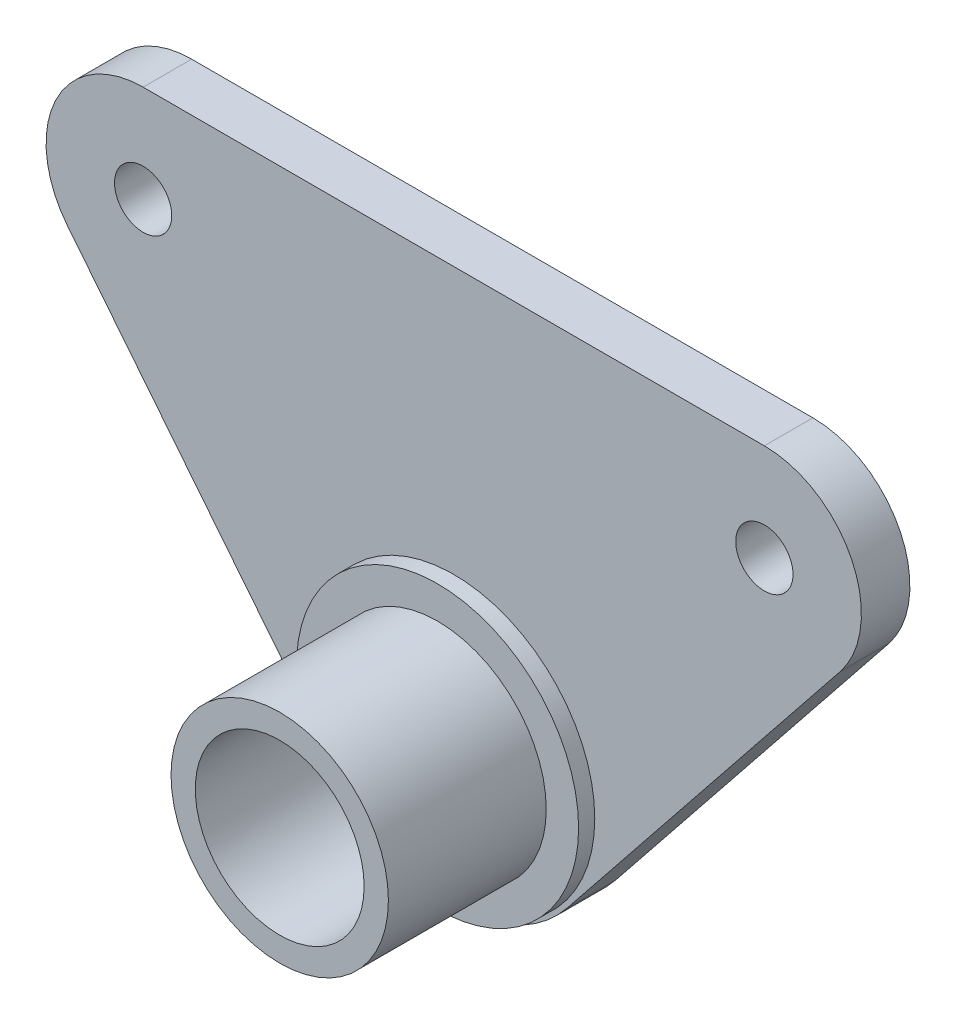
ISO-10303-21;
HEADER;
FILE_DESCRIPTION(('STEP AP214'),'2;1');
FILE_NAME('part.step','',(''),(''),'','','');
FILE_SCHEMA(('AUTOMOTIVE_DESIGN { 1 0 10303 214 1 1 1 1 }'));
ENDSEC;
DATA;
#1=APPLICATION_CONTEXT('core data for automotive mechanical design processes');
#2=APPLICATION_PROTOCOL_DEFINITION('international standard','automotive_design',2000,#1);
#3=PRODUCT_CONTEXT('',#1,'mechanical');
#4=PRODUCT('Part','Part','',(#3));
#5=PRODUCT_RELATED_PRODUCT_CATEGORY('part','',(#4));
#6=PRODUCT_DEFINITION_FORMATION('','',#4);
#7=PRODUCT_DEFINITION_CONTEXT('part definition',#1,'design');
#8=PRODUCT_DEFINITION('design','',#6,#7);
#9=PRODUCT_DEFINITION_SHAPE('','',#8);
#10=(LENGTH_UNIT() NAMED_UNIT(*) SI_UNIT(.MILLI.,.METRE.));
#11=(NAMED_UNIT(*) PLANE_ANGLE_UNIT() SI_UNIT($,.RADIAN.));
#12=(NAMED_UNIT(*) SI_UNIT($,.STERADIAN.) SOLID_ANGLE_UNIT());
#13=UNCERTAINTY_MEASURE_WITH_UNIT(LENGTH_MEASURE(1.E-05),#10,'distance_accuracy_value','');
#14=(GEOMETRIC_REPRESENTATION_CONTEXT(3) GLOBAL_UNCERTAINTY_ASSIGNED_CONTEXT((#13)) GLOBAL_UNIT_ASSIGNED_CONTEXT((#10,
#11,#12)) REPRESENTATION_CONTEXT('',''));
#15=CARTESIAN_POINT('',(0.,0.,0.));
#16=DIRECTION('',(0.,0.,1.));
#17=DIRECTION('',(1.,0.,0.));
#18=AXIS2_PLACEMENT_3D('',#15,#16,#17);
#19=CARTESIAN_POINT('',(0.,0.,3.81));
#20=DIRECTION('',(0.,0.,1.));
#21=DIRECTION('',(1.,0.,0.));
#22=AXIS2_PLACEMENT_3D('',#19,#20,#21);
#23=PLANE('',#22);
#24=CARTESIAN_POINT('',(-24.39,24.39,3.81));
#25=DIRECTION('',(0.,0.,1.));
#26=DIRECTION('',(1.,0.,0.));
#27=AXIS2_PLACEMENT_3D('',#24,#25,#26);
#28=CIRCLE('',#27,2.2479);
#29=CARTESIAN_POINT('',(-22.1421,24.39,3.81));
#30=VERTEX_POINT('',#29);
#31=EDGE_CURVE('E172',#30,#30,#28,.T.);
#32=ORIENTED_EDGE('',*,*,#31,.F.);
#33=EDGE_LOOP('',(#32));
#34=FACE_BOUND('',#33,.T.);
#35=CARTESIAN_POINT('',(24.39,24.39,3.81));
#36=DIRECTION('',(0.,0.,1.));
#37=DIRECTION('',(1.,0.,0.));
#38=AXIS2_PLACEMENT_3D('',#35,#36,#37);
#39=CIRCLE('',#38,2.2479);
#40=CARTESIAN_POINT('',(26.6379,24.39,3.81));
#41=VERTEX_POINT('',#40);
#42=EDGE_CURVE('E166',#41,#41,#39,.T.);
#43=ORIENTED_EDGE('',*,*,#42,.F.);
#44=EDGE_LOOP('',(#43));
#45=FACE_BOUND('',#44,.T.);
#46=CARTESIAN_POINT('',(0.,0.,3.81));
#47=DIRECTION('',(0.,0.,1.));
#48=DIRECTION('',(1.,0.,0.));
#49=AXIS2_PLACEMENT_3D('',#46,#47,#48);
#50=CIRCLE('',#49,11.0744);
#51=CARTESIAN_POINT('',(11.0744,0.,3.81));
#52=VERTEX_POINT('',#51);
#53=EDGE_CURVE('E11',#52,#52,#50,.T.);
#54=ORIENTED_EDGE('',*,*,#53,.F.);
#55=EDGE_LOOP('',(#54));
#56=FACE_BOUND('',#55,.T.);
#57=CARTESIAN_POINT('',(0.,0.,3.81));
#58=DIRECTION('',(0.,0.,1.));
#59=DIRECTION('',(1.,0.,0.));
#60=AXIS2_PLACEMENT_3D('',#57,#58,#59);
#61=CIRCLE('',#60,11.43);
#62=CARTESIAN_POINT('',(-8.92552251414634,-7.1400243591648,3.81));
#63=VERTEX_POINT('',#62);
#64=CARTESIAN_POINT('',(8.92552251414635,-7.1400243591648,3.81));
#65=VERTEX_POINT('',#64);
#66=EDGE_CURVE('E130',#63,#65,#61,.T.);
#67=ORIENTED_EDGE('',*,*,#66,.T.);
#68=DIRECTION('',(0.624674047171023,0.780885609286645,0.));
#69=VECTOR('',#68,1.);
#70=CARTESIAN_POINT('',(8.92552251414635,-7.1400243591648,3.81));
#71=LINE('',#70,#69);
#72=CARTESIAN_POINT('',(30.3403483427642,19.6299837605568,3.81));
#73=VERTEX_POINT('',#72);
#74=EDGE_CURVE('E89',#65,#73,#71,.T.);
#75=ORIENTED_EDGE('',*,*,#74,.T.);
#76=CARTESIAN_POINT('',(24.39,24.39,3.81));
#77=DIRECTION('',(0.,0.,1.));
#78=DIRECTION('',(1.,0.,0.));
#79=AXIS2_PLACEMENT_3D('',#76,#77,#78);
#80=CIRCLE('',#79,7.62);
#81=CARTESIAN_POINT('',(24.39,32.01,3.81));
#82=VERTEX_POINT('',#81);
#83=EDGE_CURVE('E101',#73,#82,#80,.T.);
#84=ORIENTED_EDGE('',*,*,#83,.T.);
#85=DIRECTION('',(-1.,0.,0.));
#86=VECTOR('',#85,1.);
#87=CARTESIAN_POINT('',(-24.39,32.01,3.81));
#88=LINE('',#87,#86);
#89=CARTESIAN_POINT('',(-24.39,32.01,3.81));
#90=VERTEX_POINT('',#89);
#91=EDGE_CURVE('E96',#82,#90,#88,.T.);
#92=ORIENTED_EDGE('',*,*,#91,.T.);
#93=CARTESIAN_POINT('',(-24.39,24.39,3.81));
#94=DIRECTION('',(0.,0.,1.));
#95=DIRECTION('',(-1.,0.,0.));
#96=AXIS2_PLACEMENT_3D('',#93,#94,#95);
#97=CIRCLE('',#96,7.62);
#98=CARTESIAN_POINT('',(-30.3403483427642,19.6299837605568,3.81));
#99=VERTEX_POINT('',#98);
#100=EDGE_CURVE('E99',#90,#99,#97,.T.);
#101=ORIENTED_EDGE('',*,*,#100,.T.);
#102=DIRECTION('',(0.624674047171024,-0.780885609286644,0.));
#103=VECTOR('',#102,1.);
#104=CARTESIAN_POINT('',(-8.92552251414634,-7.1400243591648,3.81));
#105=LINE('',#104,#103);
#106=EDGE_CURVE('E51',#99,#63,#105,.T.);
#107=ORIENTED_EDGE('',*,*,#106,.T.);
#108=EDGE_LOOP('',(#67,#75,#84,#92,#101,#107));
#109=FACE_BOUND('',#108,.T.);
#110=ADVANCED_FACE('F33',(#34,#45,#56,#109),#23,.T.);
#111=CARTESIAN_POINT('',(0.,0.,3.81));
#112=DIRECTION('',(0.,0.,-1.));
#113=DIRECTION('',(-1.,0.,0.));
#114=AXIS2_PLACEMENT_3D('',#111,#112,#113);
#115=CYLINDRICAL_SURFACE('',#114,11.43);
#116=CARTESIAN_POINT('',(0.,0.,0.));
#117=DIRECTION('',(0.,0.,1.));
#118=DIRECTION('',(1.,0.,0.));
#119=AXIS2_PLACEMENT_3D('',#116,#117,#118);
#120=CIRCLE('',#119,11.43);
#121=CARTESIAN_POINT('',(-8.92552251414634,-7.1400243591648,0.));
#122=VERTEX_POINT('',#121);
#123=CARTESIAN_POINT('',(8.92552251414635,-7.1400243591648,0.));
#124=VERTEX_POINT('',#123);
#125=EDGE_CURVE('E119',#122,#124,#120,.T.);
#126=ORIENTED_EDGE('',*,*,#125,.T.);
#127=DIRECTION('',(0.,0.,-1.));
#128=VECTOR('',#127,1.);
#129=CARTESIAN_POINT('',(8.92552251414635,-7.1400243591648,3.81));
#130=LINE('',#129,#128);
#131=EDGE_CURVE('E37',#65,#124,#130,.T.);
#132=ORIENTED_EDGE('',*,*,#131,.F.);
#133=ORIENTED_EDGE('',*,*,#66,.F.);
#134=DIRECTION('',(0.,0.,-1.));
#135=VECTOR('',#134,1.);
#136=CARTESIAN_POINT('',(-8.92552251414634,-7.1400243591648,3.81));
#137=LINE('',#136,#135);
#138=EDGE_CURVE('E115',#63,#122,#137,.T.);
#139=ORIENTED_EDGE('',*,*,#138,.T.);
#140=EDGE_LOOP('',(#126,#132,#133,#139));
#141=FACE_BOUND('',#140,.T.);
#142=ADVANCED_FACE('F35',(#141),#115,.T.);
#143=CARTESIAN_POINT('',(8.92552251414635,-7.1400243591648,3.81));
#144=DIRECTION('',(-0.780885609286645,0.624674047171023,0.));
#145=DIRECTION('',(-0.624674047171023,-0.780885609286645,0.));
#146=AXIS2_PLACEMENT_3D('',#143,#144,#145);
#147=PLANE('',#146);
#148=DIRECTION('',(0.624674047171023,0.780885609286645,0.));
#149=VECTOR('',#148,1.);
#150=CARTESIAN_POINT('',(8.92552251414635,-7.1400243591648,0.));
#151=LINE('',#150,#149);
#152=CARTESIAN_POINT('',(30.3403483427642,19.6299837605568,0.));
#153=VERTEX_POINT('',#152);
#154=EDGE_CURVE('E122',#124,#153,#151,.T.);
#155=ORIENTED_EDGE('',*,*,#154,.T.);
#156=DIRECTION('',(0.,0.,-1.));
#157=VECTOR('',#156,1.);
#158=CARTESIAN_POINT('',(30.3403483427642,19.6299837605568,3.81));
#159=LINE('',#158,#157);
#160=EDGE_CURVE('E133',#73,#153,#159,.T.);
#161=ORIENTED_EDGE('',*,*,#160,.F.);
#162=ORIENTED_EDGE('',*,*,#74,.F.);
#163=ORIENTED_EDGE('',*,*,#131,.T.);
#164=EDGE_LOOP('',(#155,#161,#162,#163));
#165=FACE_BOUND('',#164,.T.);
#166=ADVANCED_FACE('F138',(#165),#147,.F.);
#167=CARTESIAN_POINT('',(24.39,24.39,3.81));
#168=DIRECTION('',(0.,0.,-1.));
#169=DIRECTION('',(-1.,0.,0.));
#170=AXIS2_PLACEMENT_3D('',#167,#168,#169);
#171=CYLINDRICAL_SURFACE('',#170,7.62);
#172=CARTESIAN_POINT('',(24.39,24.39,0.));
#173=DIRECTION('',(0.,0.,1.));
#174=DIRECTION('',(1.,0.,0.));
#175=AXIS2_PLACEMENT_3D('',#172,#173,#174);
#176=CIRCLE('',#175,7.62);
#177=CARTESIAN_POINT('',(24.39,32.01,0.));
#178=VERTEX_POINT('',#177);
#179=EDGE_CURVE('E125',#153,#178,#176,.T.);
#180=ORIENTED_EDGE('',*,*,#179,.T.);
#181=DIRECTION('',(0.,0.,-1.));
#182=VECTOR('',#181,1.);
#183=CARTESIAN_POINT('',(24.39,32.01,3.81));
#184=LINE('',#183,#182);
#185=EDGE_CURVE('E110',#82,#178,#184,.T.);
#186=ORIENTED_EDGE('',*,*,#185,.F.);
#187=ORIENTED_EDGE('',*,*,#83,.F.);
#188=ORIENTED_EDGE('',*,*,#160,.T.);
#189=EDGE_LOOP('',(#180,#186,#187,#188));
#190=FACE_BOUND('',#189,.T.);
#191=ADVANCED_FACE('F145',(#190),#171,.T.);
#192=CARTESIAN_POINT('',(-24.39,32.01,3.81));
#193=DIRECTION('',(0.,-1.,0.));
#194=DIRECTION('',(0.,0.,-1.));
#195=AXIS2_PLACEMENT_3D('',#192,#193,#194);
#196=PLANE('',#195);
#197=DIRECTION('',(-1.,0.,0.));
#198=VECTOR('',#197,1.);
#199=CARTESIAN_POINT('',(-24.39,32.01,0.));
#200=LINE('',#199,#198);
#201=CARTESIAN_POINT('',(-24.39,32.01,0.));
#202=VERTEX_POINT('',#201);
#203=EDGE_CURVE('E109',#178,#202,#200,.T.);
#204=ORIENTED_EDGE('',*,*,#203,.T.);
#205=DIRECTION('',(0.,0.,-1.));
#206=VECTOR('',#205,1.);
#207=CARTESIAN_POINT('',(-24.39,32.01,3.81));
#208=LINE('',#207,#206);
#209=EDGE_CURVE('E106',#90,#202,#208,.T.);
#210=ORIENTED_EDGE('',*,*,#209,.F.);
#211=ORIENTED_EDGE('',*,*,#91,.F.);
#212=ORIENTED_EDGE('',*,*,#185,.T.);
#213=EDGE_LOOP('',(#204,#210,#211,#212));
#214=FACE_BOUND('',#213,.T.);
#215=ADVANCED_FACE('F107',(#214),#196,.F.);
#216=CARTESIAN_POINT('',(-24.39,24.39,3.81));
#217=DIRECTION('',(0.,0.,-1.));
#218=DIRECTION('',(-1.,0.,0.));
#219=AXIS2_PLACEMENT_3D('',#216,#217,#218);
#220=CYLINDRICAL_SURFACE('',#219,7.62);
#221=CARTESIAN_POINT('',(-24.39,24.39,0.));
#222=DIRECTION('',(0.,0.,1.));
#223=DIRECTION('',(-1.,0.,0.));
#224=AXIS2_PLACEMENT_3D('',#221,#222,#223);
#225=CIRCLE('',#224,7.62);
#226=CARTESIAN_POINT('',(-30.3403483427642,19.6299837605568,0.));
#227=VERTEX_POINT('',#226);
#228=EDGE_CURVE('E74',#202,#227,#225,.T.);
#229=ORIENTED_EDGE('',*,*,#228,.T.);
#230=DIRECTION('',(0.,0.,-1.));
#231=VECTOR('',#230,1.);
#232=CARTESIAN_POINT('',(-30.3403483427642,19.6299837605568,3.81));
#233=LINE('',#232,#231);
#234=EDGE_CURVE('E111',#99,#227,#233,.T.);
#235=ORIENTED_EDGE('',*,*,#234,.F.);
#236=ORIENTED_EDGE('',*,*,#100,.F.);
#237=ORIENTED_EDGE('',*,*,#209,.T.);
#238=EDGE_LOOP('',(#229,#235,#236,#237));
#239=FACE_BOUND('',#238,.T.);
#240=ADVANCED_FACE('F113',(#239),#220,.T.);
#241=CARTESIAN_POINT('',(-8.92552251414634,-7.1400243591648,3.81));
#242=DIRECTION('',(0.780885609286644,0.624674047171024,0.));
#243=DIRECTION('',(-0.624674047171024,0.780885609286644,0.));
#244=AXIS2_PLACEMENT_3D('',#241,#242,#243);
#245=PLANE('',#244);
#246=DIRECTION('',(0.624674047171024,-0.780885609286644,0.));
#247=VECTOR('',#246,1.);
#248=CARTESIAN_POINT('',(-8.92552251414634,-7.1400243591648,0.));
#249=LINE('',#248,#247);
#250=EDGE_CURVE('E80',#227,#122,#249,.T.);
#251=ORIENTED_EDGE('',*,*,#250,.T.);
#252=ORIENTED_EDGE('',*,*,#138,.F.);
#253=ORIENTED_EDGE('',*,*,#106,.F.);
#254=ORIENTED_EDGE('',*,*,#234,.T.);
#255=EDGE_LOOP('',(#251,#252,#253,#254));
#256=FACE_BOUND('',#255,.T.);
#257=ADVANCED_FACE('F216',(#256),#245,.F.);
#258=CARTESIAN_POINT('',(0.,0.,0.));
#259=DIRECTION('',(0.,0.,1.));
#260=DIRECTION('',(1.,0.,0.));
#261=AXIS2_PLACEMENT_3D('',#258,#259,#260);
#262=PLANE('',#261);
#263=CARTESIAN_POINT('',(-24.39,24.39,0.));
#264=DIRECTION('',(0.,0.,1.));
#265=DIRECTION('',(1.,0.,0.));
#266=AXIS2_PLACEMENT_3D('',#263,#264,#265);
#267=CIRCLE('',#266,2.2479);
#268=CARTESIAN_POINT('',(-22.1421,24.39,0.));
#269=VERTEX_POINT('',#268);
#270=EDGE_CURVE('E169',#269,#269,#267,.T.);
#271=ORIENTED_EDGE('',*,*,#270,.T.);
#272=EDGE_LOOP('',(#271));
#273=FACE_BOUND('',#272,.T.);
#274=CARTESIAN_POINT('',(24.39,24.39,0.));
#275=DIRECTION('',(0.,0.,1.));
#276=DIRECTION('',(1.,0.,0.));
#277=AXIS2_PLACEMENT_3D('',#274,#275,#276);
#278=CIRCLE('',#277,2.2479);
#279=CARTESIAN_POINT('',(26.6379,24.39,0.));
#280=VERTEX_POINT('',#279);
#281=EDGE_CURVE('E163',#280,#280,#278,.T.);
#282=ORIENTED_EDGE('',*,*,#281,.T.);
#283=EDGE_LOOP('',(#282));
#284=FACE_BOUND('',#283,.T.);
#285=ORIENTED_EDGE('',*,*,#125,.F.);
#286=ORIENTED_EDGE('',*,*,#250,.F.);
#287=ORIENTED_EDGE('',*,*,#228,.F.);
#288=ORIENTED_EDGE('',*,*,#203,.F.);
#289=ORIENTED_EDGE('',*,*,#179,.F.);
#290=ORIENTED_EDGE('',*,*,#154,.F.);
#291=EDGE_LOOP('',(#285,#286,#287,#288,#289,#290));
#292=FACE_BOUND('',#291,.T.);
#293=CARTESIAN_POINT('',(0.,0.,0.));
#294=DIRECTION('',(0.,0.,1.));
#295=DIRECTION('',(1.,0.,0.));
#296=AXIS2_PLACEMENT_3D('',#293,#294,#295);
#297=CIRCLE('',#296,6.6294);
#298=CARTESIAN_POINT('',(6.6294,0.,0.));
#299=VERTEX_POINT('',#298);
#300=EDGE_CURVE('E154',#299,#299,#297,.T.);
#301=ORIENTED_EDGE('',*,*,#300,.T.);
#302=EDGE_LOOP('',(#301));
#303=FACE_BOUND('',#302,.T.);
#304=ADVANCED_FACE('F143',(#273,#284,#292,#303),#262,.F.);
#305=CARTESIAN_POINT('',(0.,0.,17.4752));
#306=DIRECTION('',(0.,0.,1.));
#307=DIRECTION('',(1.,0.,0.));
#308=AXIS2_PLACEMENT_3D('',#305,#306,#307);
#309=PLANE('',#308);
#310=CARTESIAN_POINT('',(0.,0.,17.4752));
#311=DIRECTION('',(0.,0.,1.));
#312=DIRECTION('',(1.,0.,0.));
#313=AXIS2_PLACEMENT_3D('',#310,#311,#312);
#314=CIRCLE('',#313,8.5344);
#315=CARTESIAN_POINT('',(8.5344,0.,17.4752));
#316=VERTEX_POINT('',#315);
#317=EDGE_CURVE('E123',#316,#316,#314,.T.);
#318=ORIENTED_EDGE('',*,*,#317,.T.);
#319=EDGE_LOOP('',(#318));
#320=FACE_BOUND('',#319,.T.);
#321=CARTESIAN_POINT('',(0.,0.,17.4752));
#322=DIRECTION('',(0.,0.,1.));
#323=DIRECTION('',(1.,0.,0.));
#324=AXIS2_PLACEMENT_3D('',#321,#322,#323);
#325=CIRCLE('',#324,6.6294);
#326=CARTESIAN_POINT('',(6.6294,0.,17.4752));
#327=VERTEX_POINT('',#326);
#328=EDGE_CURVE('E151',#327,#327,#325,.T.);
#329=ORIENTED_EDGE('',*,*,#328,.F.);
#330=EDGE_LOOP('',(#329));
#331=FACE_BOUND('',#330,.T.);
#332=ADVANCED_FACE('F202',(#320,#331),#309,.T.);
#333=CARTESIAN_POINT('',(0.,0.,17.4752));
#334=DIRECTION('',(0.,0.,-1.));
#335=DIRECTION('',(-1.,0.,0.));
#336=AXIS2_PLACEMENT_3D('',#333,#334,#335);
#337=CYLINDRICAL_SURFACE('',#336,8.5344);
#338=CARTESIAN_POINT('',(0.,0.,5.08));
#339=DIRECTION('',(0.,0.,1.));
#340=DIRECTION('',(1.,0.,0.));
#341=AXIS2_PLACEMENT_3D('',#338,#339,#340);
#342=CIRCLE('',#341,8.5344);
#343=CARTESIAN_POINT('',(8.5344,0.,5.08));
#344=VERTEX_POINT('',#343);
#345=EDGE_CURVE('E160',#344,#344,#342,.T.);
#346=ORIENTED_EDGE('',*,*,#345,.T.);
#347=EDGE_LOOP('',(#346));
#348=FACE_BOUND('',#347,.T.);
#349=ORIENTED_EDGE('',*,*,#317,.F.);
#350=EDGE_LOOP('',(#349));
#351=FACE_BOUND('',#350,.T.);
#352=ADVANCED_FACE('F199',(#348,#351),#337,.T.);
#353=CARTESIAN_POINT('',(0.,0.,17.4752));
#354=DIRECTION('',(0.,0.,-1.));
#355=DIRECTION('',(-1.,0.,0.));
#356=AXIS2_PLACEMENT_3D('',#353,#354,#355);
#357=CYLINDRICAL_SURFACE('',#356,6.6294);
#358=ORIENTED_EDGE('',*,*,#328,.T.);
#359=EDGE_LOOP('',(#358));
#360=FACE_BOUND('',#359,.T.);
#361=ORIENTED_EDGE('',*,*,#300,.F.);
#362=EDGE_LOOP('',(#361));
#363=FACE_BOUND('',#362,.T.);
#364=ADVANCED_FACE('F189',(#360,#363),#357,.F.);
#365=CARTESIAN_POINT('',(0.,0.,-31.3231333502892));
#366=DIRECTION('',(0.,0.,1.));
#367=DIRECTION('',(1.,0.,0.));
#368=AXIS2_PLACEMENT_3D('',#365,#366,#367);
#369=CYLINDRICAL_SURFACE('',#368,11.0744);
#370=ORIENTED_EDGE('',*,*,#53,.T.);
#371=EDGE_LOOP('',(#370));
#372=FACE_BOUND('',#371,.T.);
#373=CARTESIAN_POINT('',(0.,0.,5.08));
#374=DIRECTION('',(0.,0.,1.));
#375=DIRECTION('',(1.,0.,0.));
#376=AXIS2_PLACEMENT_3D('',#373,#374,#375);
#377=CIRCLE('',#376,11.0744);
#378=CARTESIAN_POINT('',(11.0744,0.,5.08));
#379=VERTEX_POINT('',#378);
#380=EDGE_CURVE('E156',#379,#379,#377,.T.);
#381=ORIENTED_EDGE('',*,*,#380,.F.);
#382=EDGE_LOOP('',(#381));
#383=FACE_BOUND('',#382,.T.);
#384=ADVANCED_FACE('F185',(#372,#383),#369,.T.);
#385=CARTESIAN_POINT('',(0.,0.,5.08));
#386=DIRECTION('',(0.,0.,1.));
#387=DIRECTION('',(1.,0.,0.));
#388=AXIS2_PLACEMENT_3D('',#385,#386,#387);
#389=PLANE('',#388);
#390=ORIENTED_EDGE('',*,*,#380,.T.);
#391=EDGE_LOOP('',(#390));
#392=FACE_BOUND('',#391,.T.);
#393=ORIENTED_EDGE('',*,*,#345,.F.);
#394=EDGE_LOOP('',(#393));
#395=FACE_BOUND('',#394,.T.);
#396=ADVANCED_FACE('F188',(#392,#395),#389,.T.);
#397=CARTESIAN_POINT('',(24.39,24.39,3.81));
#398=DIRECTION('',(0.,0.,1.));
#399=DIRECTION('',(1.,0.,0.));
#400=AXIS2_PLACEMENT_3D('',#397,#398,#399);
#401=CYLINDRICAL_SURFACE('',#400,2.2479);
#402=ORIENTED_EDGE('',*,*,#281,.F.);
#403=EDGE_LOOP('',(#402));
#404=FACE_BOUND('',#403,.T.);
#405=ORIENTED_EDGE('',*,*,#42,.T.);
#406=EDGE_LOOP('',(#405));
#407=FACE_BOUND('',#406,.T.);
#408=ADVANCED_FACE('F195',(#404,#407),#401,.F.);
#409=CARTESIAN_POINT('',(-24.39,24.39,3.81));
#410=DIRECTION('',(0.,0.,1.));
#411=DIRECTION('',(1.,0.,0.));
#412=AXIS2_PLACEMENT_3D('',#409,#410,#411);
#413=CYLINDRICAL_SURFACE('',#412,2.2479);
#414=ORIENTED_EDGE('',*,*,#270,.F.);
#415=EDGE_LOOP('',(#414));
#416=FACE_BOUND('',#415,.T.);
#417=ORIENTED_EDGE('',*,*,#31,.T.);
#418=EDGE_LOOP('',(#417));
#419=FACE_BOUND('',#418,.T.);
#420=ADVANCED_FACE('F176',(#416,#419),#413,.F.);
#421=CLOSED_SHELL('',(#110,#142,#166,#191,#215,#240,#257,#304,#332,#352,#364,#384,#396,#408,#420));
#422=MANIFOLD_SOLID_BREP('B2',#421);
#423=ADVANCED_BREP_SHAPE_REPRESENTATION('',(#18,#422),#14);
#424=SHAPE_DEFINITION_REPRESENTATION(#9,#423);
ENDSEC;
END-ISO-10303-21;
